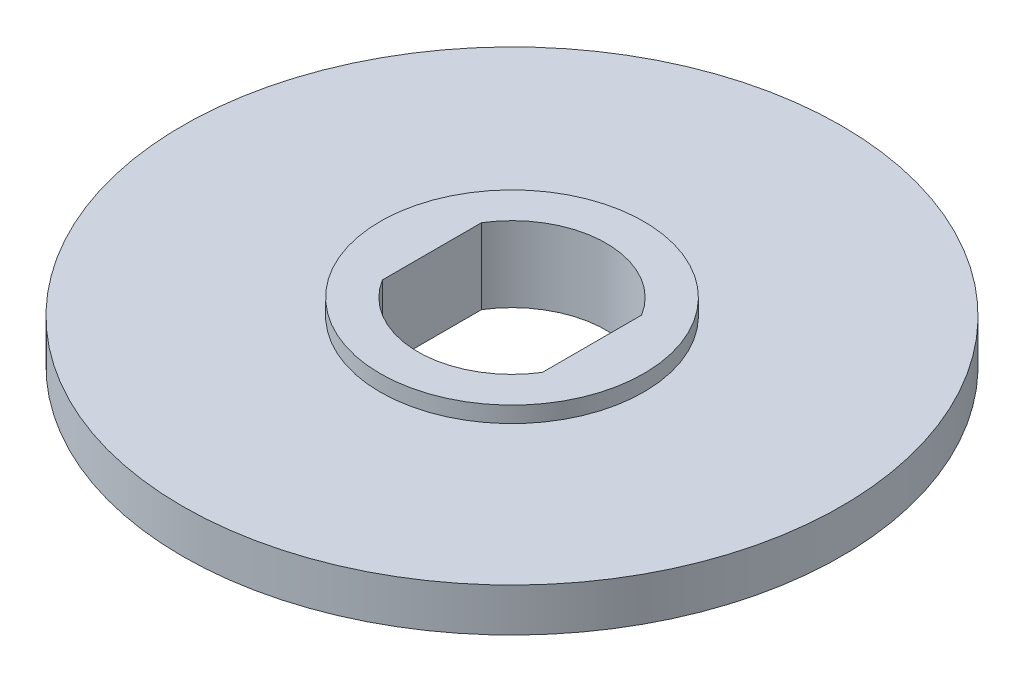
ISO-10303-21;
HEADER;
FILE_DESCRIPTION(('STEP AP214'),'2;1');
FILE_NAME('part.step','',(''),(''),'','','');
FILE_SCHEMA(('AUTOMOTIVE_DESIGN { 1 0 10303 214 1 1 1 1 }'));
ENDSEC;
DATA;
#1=APPLICATION_CONTEXT('core data for automotive mechanical design processes');
#2=APPLICATION_PROTOCOL_DEFINITION('international standard','automotive_design',2000,#1);
#3=PRODUCT_CONTEXT('',#1,'mechanical');
#4=PRODUCT('Part','Part','',(#3));
#5=PRODUCT_RELATED_PRODUCT_CATEGORY('part','',(#4));
#6=PRODUCT_DEFINITION_FORMATION('','',#4);
#7=PRODUCT_DEFINITION_CONTEXT('part definition',#1,'design');
#8=PRODUCT_DEFINITION('design','',#6,#7);
#9=PRODUCT_DEFINITION_SHAPE('','',#8);
#10=(LENGTH_UNIT() NAMED_UNIT(*) SI_UNIT(.MILLI.,.METRE.));
#11=(NAMED_UNIT(*) PLANE_ANGLE_UNIT() SI_UNIT($,.RADIAN.));
#12=(NAMED_UNIT(*) SI_UNIT($,.STERADIAN.) SOLID_ANGLE_UNIT());
#13=UNCERTAINTY_MEASURE_WITH_UNIT(LENGTH_MEASURE(1.E-05),#10,'distance_accuracy_value','');
#14=(GEOMETRIC_REPRESENTATION_CONTEXT(3) GLOBAL_UNCERTAINTY_ASSIGNED_CONTEXT((#13)) GLOBAL_UNIT_ASSIGNED_CONTEXT((#10,
#11,#12)) REPRESENTATION_CONTEXT('',''));
#15=CARTESIAN_POINT('',(0.,0.,0.));
#16=DIRECTION('',(0.,0.,1.));
#17=DIRECTION('',(1.,0.,0.));
#18=AXIS2_PLACEMENT_3D('',#15,#16,#17);
#19=CARTESIAN_POINT('',(0.,2.,0.));
#20=DIRECTION('',(0.,-1.,0.));
#21=DIRECTION('',(0.,0.,-1.));
#22=AXIS2_PLACEMENT_3D('',#19,#20,#21);
#23=CYLINDRICAL_SURFACE('',#22,7.);
#24=CARTESIAN_POINT('',(0.,-2.,0.));
#25=DIRECTION('',(0.,1.,0.));
#26=DIRECTION('',(0.,0.,1.));
#27=AXIS2_PLACEMENT_3D('',#24,#25,#26);
#28=CIRCLE('',#27,7.);
#29=CARTESIAN_POINT('',(0.,-2.,7.));
#30=VERTEX_POINT('',#29);
#31=EDGE_CURVE('E116',#30,#30,#28,.T.);
#32=ORIENTED_EDGE('',*,*,#31,.T.);
#33=EDGE_LOOP('',(#32));
#34=FACE_BOUND('',#33,.T.);
#35=CARTESIAN_POINT('',(0.,-1.15,0.));
#36=DIRECTION('',(0.,1.,0.));
#37=DIRECTION('',(0.,0.,1.));
#38=AXIS2_PLACEMENT_3D('',#35,#36,#37);
#39=CIRCLE('',#38,7.);
#40=CARTESIAN_POINT('',(0.,-1.15,7.));
#41=VERTEX_POINT('',#40);
#42=EDGE_CURVE('E11',#41,#41,#39,.T.);
#43=ORIENTED_EDGE('',*,*,#42,.F.);
#44=EDGE_LOOP('',(#43));
#45=FACE_BOUND('',#44,.T.);
#46=ADVANCED_FACE('F43',(#34,#45),#23,.T.);
#47=CARTESIAN_POINT('',(0.,2.,0.));
#48=DIRECTION('',(0.,-1.,0.));
#49=DIRECTION('',(0.,0.,-1.));
#50=AXIS2_PLACEMENT_3D('',#47,#48,#49);
#51=CYLINDRICAL_SURFACE('',#50,5.);
#52=CARTESIAN_POINT('',(0.,-2.,0.));
#53=DIRECTION('',(0.,1.,0.));
#54=DIRECTION('',(0.,0.,1.));
#55=AXIS2_PLACEMENT_3D('',#52,#53,#54);
#56=CIRCLE('',#55,5.);
#57=CARTESIAN_POINT('',(-4.25,-2.,2.63391343821319));
#58=VERTEX_POINT('',#57);
#59=CARTESIAN_POINT('',(4.25,-2.,2.63391343821319));
#60=VERTEX_POINT('',#59);
#61=EDGE_CURVE('E133',#58,#60,#56,.T.);
#62=ORIENTED_EDGE('',*,*,#61,.F.);
#63=DIRECTION('',(0.,-1.,0.));
#64=VECTOR('',#63,1.);
#65=CARTESIAN_POINT('',(-4.25,2.,2.63391343821319));
#66=LINE('',#65,#64);
#67=CARTESIAN_POINT('',(-4.25,2.,2.63391343821319));
#68=VERTEX_POINT('',#67);
#69=EDGE_CURVE('E53',#68,#58,#66,.T.);
#70=ORIENTED_EDGE('',*,*,#69,.F.);
#71=CARTESIAN_POINT('',(0.,2.,0.));
#72=DIRECTION('',(0.,1.,0.));
#73=DIRECTION('',(0.,0.,1.));
#74=AXIS2_PLACEMENT_3D('',#71,#72,#73);
#75=CIRCLE('',#74,5.);
#76=CARTESIAN_POINT('',(4.25,2.,2.63391343821319));
#77=VERTEX_POINT('',#76);
#78=EDGE_CURVE('E105',#68,#77,#75,.T.);
#79=ORIENTED_EDGE('',*,*,#78,.T.);
#80=DIRECTION('',(0.,-1.,0.));
#81=VECTOR('',#80,1.);
#82=CARTESIAN_POINT('',(4.25,2.,2.63391343821319));
#83=LINE('',#82,#81);
#84=EDGE_CURVE('E84',#77,#60,#83,.T.);
#85=ORIENTED_EDGE('',*,*,#84,.T.);
#86=EDGE_LOOP('',(#62,#70,#79,#85));
#87=FACE_BOUND('',#86,.T.);
#88=ADVANCED_FACE('F134',(#87),#51,.F.);
#89=CARTESIAN_POINT('',(-4.25,2.,0.));
#90=DIRECTION('',(1.,0.,0.));
#91=DIRECTION('',(0.,0.,-1.));
#92=AXIS2_PLACEMENT_3D('',#89,#90,#91);
#93=PLANE('',#92);
#94=DIRECTION('',(0.,0.,1.));
#95=VECTOR('',#94,1.);
#96=CARTESIAN_POINT('',(-4.25,-2.,0.));
#97=LINE('',#96,#95);
#98=CARTESIAN_POINT('',(-4.25,-2.,-2.63391343821319));
#99=VERTEX_POINT('',#98);
#100=EDGE_CURVE('E95',#99,#58,#97,.T.);
#101=ORIENTED_EDGE('',*,*,#100,.F.);
#102=DIRECTION('',(0.,-1.,0.));
#103=VECTOR('',#102,1.);
#104=CARTESIAN_POINT('',(-4.25,2.,-2.63391343821319));
#105=LINE('',#104,#103);
#106=CARTESIAN_POINT('',(-4.25,2.,-2.63391343821319));
#107=VERTEX_POINT('',#106);
#108=EDGE_CURVE('E91',#107,#99,#105,.T.);
#109=ORIENTED_EDGE('',*,*,#108,.F.);
#110=DIRECTION('',(0.,0.,1.));
#111=VECTOR('',#110,1.);
#112=CARTESIAN_POINT('',(-4.25,2.,0.));
#113=LINE('',#112,#111);
#114=EDGE_CURVE('E93',#107,#68,#113,.T.);
#115=ORIENTED_EDGE('',*,*,#114,.T.);
#116=ORIENTED_EDGE('',*,*,#69,.T.);
#117=EDGE_LOOP('',(#101,#109,#115,#116));
#118=FACE_BOUND('',#117,.T.);
#119=ADVANCED_FACE('F45',(#118),#93,.T.);
#120=CARTESIAN_POINT('',(4.25,-2.,-2.63391343821319));
#121=VERTEX_POINT('',#120);
#122=EDGE_CURVE('E124',#121,#99,#56,.T.);
#123=ORIENTED_EDGE('',*,*,#122,.F.);
#124=DIRECTION('',(0.,-1.,0.));
#125=VECTOR('',#124,1.);
#126=CARTESIAN_POINT('',(4.25,2.,-2.63391343821319));
#127=LINE('',#126,#125);
#128=CARTESIAN_POINT('',(4.25,2.,-2.63391343821319));
#129=VERTEX_POINT('',#128);
#130=EDGE_CURVE('E77',#129,#121,#127,.T.);
#131=ORIENTED_EDGE('',*,*,#130,.F.);
#132=EDGE_CURVE('E104',#129,#107,#75,.T.);
#133=ORIENTED_EDGE('',*,*,#132,.T.);
#134=ORIENTED_EDGE('',*,*,#108,.T.);
#135=EDGE_LOOP('',(#123,#131,#133,#134));
#136=FACE_BOUND('',#135,.T.);
#137=ADVANCED_FACE('F108',(#136),#51,.F.);
#138=CARTESIAN_POINT('',(4.25,2.,0.));
#139=DIRECTION('',(1.,0.,0.));
#140=DIRECTION('',(0.,0.,-1.));
#141=AXIS2_PLACEMENT_3D('',#138,#139,#140);
#142=PLANE('',#141);
#143=DIRECTION('',(0.,0.,1.));
#144=VECTOR('',#143,1.);
#145=CARTESIAN_POINT('',(4.25,-2.,0.));
#146=LINE('',#145,#144);
#147=EDGE_CURVE('E119',#121,#60,#146,.T.);
#148=ORIENTED_EDGE('',*,*,#147,.T.);
#149=ORIENTED_EDGE('',*,*,#84,.F.);
#150=DIRECTION('',(0.,0.,1.));
#151=VECTOR('',#150,1.);
#152=CARTESIAN_POINT('',(4.25,2.,0.));
#153=LINE('',#152,#151);
#154=EDGE_CURVE('E61',#129,#77,#153,.T.);
#155=ORIENTED_EDGE('',*,*,#154,.F.);
#156=ORIENTED_EDGE('',*,*,#130,.T.);
#157=EDGE_LOOP('',(#148,#149,#155,#156));
#158=FACE_BOUND('',#157,.T.);
#159=ADVANCED_FACE('F150',(#158),#142,.F.);
#160=CARTESIAN_POINT('',(0.,1.15,0.));
#161=DIRECTION('',(0.,1.,0.));
#162=DIRECTION('',(0.,0.,1.));
#163=AXIS2_PLACEMENT_3D('',#160,#161,#162);
#164=CIRCLE('',#163,7.);
#165=CARTESIAN_POINT('',(0.,1.15,7.));
#166=VERTEX_POINT('',#165);
#167=EDGE_CURVE('E178',#166,#166,#164,.T.);
#168=ORIENTED_EDGE('',*,*,#167,.T.);
#169=EDGE_LOOP('',(#168));
#170=FACE_BOUND('',#169,.T.);
#171=CARTESIAN_POINT('',(0.,2.,0.));
#172=DIRECTION('',(0.,1.,0.));
#173=DIRECTION('',(0.,0.,1.));
#174=AXIS2_PLACEMENT_3D('',#171,#172,#173);
#175=CIRCLE('',#174,7.);
#176=CARTESIAN_POINT('',(0.,2.,7.));
#177=VERTEX_POINT('',#176);
#178=EDGE_CURVE('E112',#177,#177,#175,.T.);
#179=ORIENTED_EDGE('',*,*,#178,.F.);
#180=EDGE_LOOP('',(#179));
#181=FACE_BOUND('',#180,.T.);
#182=ADVANCED_FACE('F148',(#170,#181),#23,.T.);
#183=CARTESIAN_POINT('',(0.,2.,0.));
#184=DIRECTION('',(0.,1.,0.));
#185=DIRECTION('',(0.,0.,1.));
#186=AXIS2_PLACEMENT_3D('',#183,#184,#185);
#187=PLANE('',#186);
#188=ORIENTED_EDGE('',*,*,#78,.F.);
#189=ORIENTED_EDGE('',*,*,#114,.F.);
#190=ORIENTED_EDGE('',*,*,#132,.F.);
#191=ORIENTED_EDGE('',*,*,#154,.T.);
#192=EDGE_LOOP('',(#188,#189,#190,#191));
#193=FACE_BOUND('',#192,.T.);
#194=ORIENTED_EDGE('',*,*,#178,.T.);
#195=EDGE_LOOP('',(#194));
#196=FACE_BOUND('',#195,.T.);
#197=ADVANCED_FACE('F102',(#193,#196),#187,.T.);
#198=CARTESIAN_POINT('',(0.,-2.,0.));
#199=DIRECTION('',(0.,1.,0.));
#200=DIRECTION('',(0.,0.,1.));
#201=AXIS2_PLACEMENT_3D('',#198,#199,#200);
#202=PLANE('',#201);
#203=ORIENTED_EDGE('',*,*,#61,.T.);
#204=ORIENTED_EDGE('',*,*,#147,.F.);
#205=ORIENTED_EDGE('',*,*,#122,.T.);
#206=ORIENTED_EDGE('',*,*,#100,.T.);
#207=EDGE_LOOP('',(#203,#204,#205,#206));
#208=FACE_BOUND('',#207,.T.);
#209=ORIENTED_EDGE('',*,*,#31,.F.);
#210=EDGE_LOOP('',(#209));
#211=FACE_BOUND('',#210,.T.);
#212=ADVANCED_FACE('F139',(#208,#211),#202,.F.);
#213=CARTESIAN_POINT('',(0.,1.15,0.));
#214=DIRECTION('',(0.,-1.,0.));
#215=DIRECTION('',(0.,0.,-1.));
#216=AXIS2_PLACEMENT_3D('',#213,#214,#215);
#217=CYLINDRICAL_SURFACE('',#216,17.5);
#218=CARTESIAN_POINT('',(0.,1.15,0.));
#219=DIRECTION('',(0.,1.,0.));
#220=DIRECTION('',(0.,0.,1.));
#221=AXIS2_PLACEMENT_3D('',#218,#219,#220);
#222=CIRCLE('',#221,17.5);
#223=CARTESIAN_POINT('',(0.,1.15,17.5));
#224=VERTEX_POINT('',#223);
#225=EDGE_CURVE('E137',#224,#224,#222,.T.);
#226=ORIENTED_EDGE('',*,*,#225,.F.);
#227=EDGE_LOOP('',(#226));
#228=FACE_BOUND('',#227,.T.);
#229=CARTESIAN_POINT('',(0.,-1.15,0.));
#230=DIRECTION('',(0.,1.,0.));
#231=DIRECTION('',(0.,0.,1.));
#232=AXIS2_PLACEMENT_3D('',#229,#230,#231);
#233=CIRCLE('',#232,17.5);
#234=CARTESIAN_POINT('',(0.,-1.15,17.5));
#235=VERTEX_POINT('',#234);
#236=EDGE_CURVE('E175',#235,#235,#233,.T.);
#237=ORIENTED_EDGE('',*,*,#236,.T.);
#238=EDGE_LOOP('',(#237));
#239=FACE_BOUND('',#238,.T.);
#240=ADVANCED_FACE('F187',(#228,#239),#217,.T.);
#241=CARTESIAN_POINT('',(0.,1.15,0.));
#242=DIRECTION('',(0.,1.,0.));
#243=DIRECTION('',(0.,0.,1.));
#244=AXIS2_PLACEMENT_3D('',#241,#242,#243);
#245=PLANE('',#244);
#246=ORIENTED_EDGE('',*,*,#167,.F.);
#247=EDGE_LOOP('',(#246));
#248=FACE_BOUND('',#247,.T.);
#249=ORIENTED_EDGE('',*,*,#225,.T.);
#250=EDGE_LOOP('',(#249));
#251=FACE_BOUND('',#250,.T.);
#252=ADVANCED_FACE('F171',(#248,#251),#245,.T.);
#253=CARTESIAN_POINT('',(0.,-1.15,0.));
#254=DIRECTION('',(0.,1.,0.));
#255=DIRECTION('',(0.,0.,1.));
#256=AXIS2_PLACEMENT_3D('',#253,#254,#255);
#257=PLANE('',#256);
#258=ORIENTED_EDGE('',*,*,#42,.T.);
#259=EDGE_LOOP('',(#258));
#260=FACE_BOUND('',#259,.T.);
#261=ORIENTED_EDGE('',*,*,#236,.F.);
#262=EDGE_LOOP('',(#261));
#263=FACE_BOUND('',#262,.T.);
#264=ADVANCED_FACE('F168',(#260,#263),#257,.F.);
#265=CLOSED_SHELL('',(#46,#88,#119,#137,#159,#182,#197,#212,#240,#252,#264));
#266=MANIFOLD_SOLID_BREP('B2',#265);
#267=ADVANCED_BREP_SHAPE_REPRESENTATION('',(#18,#266),#14);
#268=SHAPE_DEFINITION_REPRESENTATION(#9,#267);
ENDSEC;
END-ISO-10303-21;
